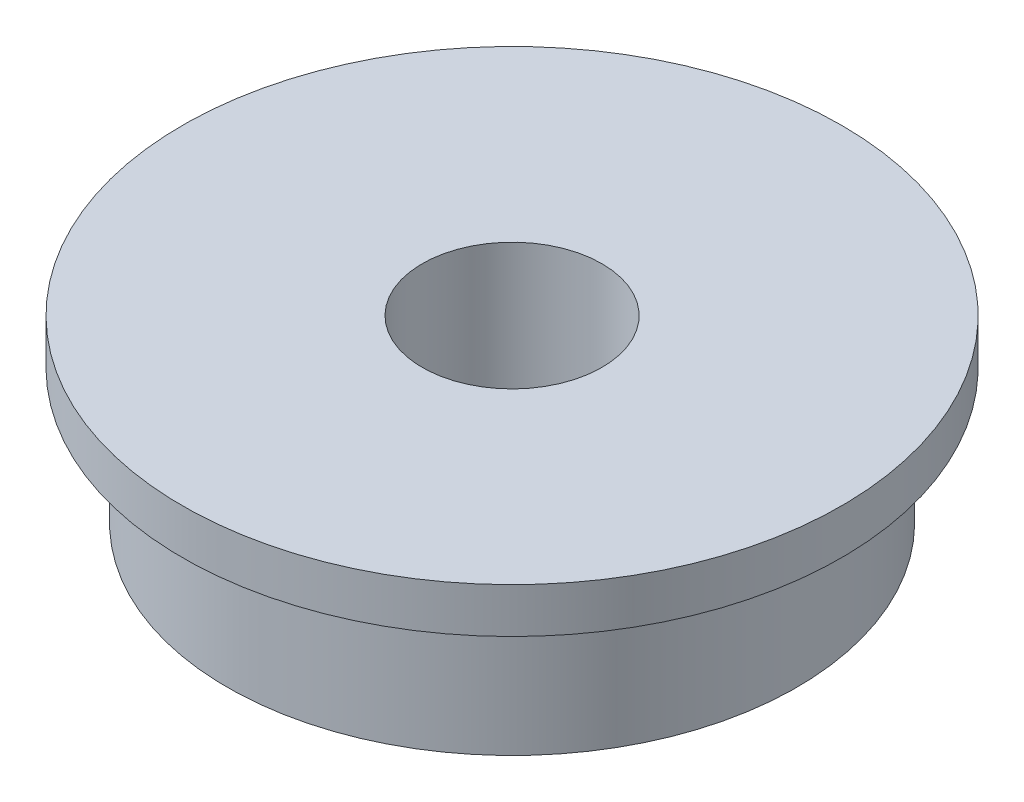
ISO-10303-21;
HEADER;
FILE_DESCRIPTION(('STEP AP214'),'2;1');
FILE_NAME('part.step','',(''),(''),'','','');
FILE_SCHEMA(('AUTOMOTIVE_DESIGN { 1 0 10303 214 1 1 1 1 }'));
ENDSEC;
DATA;
#1=APPLICATION_CONTEXT('core data for automotive mechanical design processes');
#2=APPLICATION_PROTOCOL_DEFINITION('international standard','automotive_design',2000,#1);
#3=PRODUCT_CONTEXT('',#1,'mechanical');
#4=PRODUCT('Part','Part','',(#3));
#5=PRODUCT_RELATED_PRODUCT_CATEGORY('part','',(#4));
#6=PRODUCT_DEFINITION_FORMATION('','',#4);
#7=PRODUCT_DEFINITION_CONTEXT('part definition',#1,'design');
#8=PRODUCT_DEFINITION('design','',#6,#7);
#9=PRODUCT_DEFINITION_SHAPE('','',#8);
#10=(LENGTH_UNIT() NAMED_UNIT(*) SI_UNIT(.MILLI.,.METRE.));
#11=(NAMED_UNIT(*) PLANE_ANGLE_UNIT() SI_UNIT($,.RADIAN.));
#12=(NAMED_UNIT(*) SI_UNIT($,.STERADIAN.) SOLID_ANGLE_UNIT());
#13=UNCERTAINTY_MEASURE_WITH_UNIT(LENGTH_MEASURE(1.E-05),#10,'distance_accuracy_value','');
#14=(GEOMETRIC_REPRESENTATION_CONTEXT(3) GLOBAL_UNCERTAINTY_ASSIGNED_CONTEXT((#13)) GLOBAL_UNIT_ASSIGNED_CONTEXT((#10,
#11,#12)) REPRESENTATION_CONTEXT('',''));
#15=CARTESIAN_POINT('',(0.,0.,0.));
#16=DIRECTION('',(0.,0.,1.));
#17=DIRECTION('',(1.,0.,0.));
#18=AXIS2_PLACEMENT_3D('',#15,#16,#17);
#19=CARTESIAN_POINT('',(0.,0.,0.));
#20=DIRECTION('',(0.,-1.,0.));
#21=DIRECTION('',(0.,0.,-1.));
#22=AXIS2_PLACEMENT_3D('',#19,#20,#21);
#23=CYLINDRICAL_SURFACE('',#22,9.5);
#24=CARTESIAN_POINT('',(0.,4.5,0.));
#25=DIRECTION('',(0.,-1.,0.));
#26=DIRECTION('',(0.,0.,-1.));
#27=AXIS2_PLACEMENT_3D('',#24,#25,#26);
#28=CIRCLE('',#27,9.5);
#29=CARTESIAN_POINT('',(0.,4.5,-9.5));
#30=VERTEX_POINT('',#29);
#31=EDGE_CURVE('E59',#30,#30,#28,.T.);
#32=ORIENTED_EDGE('',*,*,#31,.T.);
#33=EDGE_LOOP('',(#32));
#34=FACE_BOUND('',#33,.T.);
#35=CARTESIAN_POINT('',(0.,0.,0.));
#36=DIRECTION('',(0.,-1.,0.));
#37=DIRECTION('',(0.,0.,-1.));
#38=AXIS2_PLACEMENT_3D('',#35,#36,#37);
#39=CIRCLE('',#38,9.5);
#40=CARTESIAN_POINT('',(0.,0.,-9.5));
#41=VERTEX_POINT('',#40);
#42=EDGE_CURVE('E10',#41,#41,#39,.T.);
#43=ORIENTED_EDGE('',*,*,#42,.F.);
#44=EDGE_LOOP('',(#43));
#45=FACE_BOUND('',#44,.T.);
#46=ADVANCED_FACE('F37',(#34,#45),#23,.T.);
#47=CARTESIAN_POINT('',(9.5,0.,0.));
#48=DIRECTION('',(0.,-1.,0.));
#49=DIRECTION('',(0.,0.,-1.));
#50=AXIS2_PLACEMENT_3D('',#47,#48,#49);
#51=PLANE('',#50);
#52=ORIENTED_EDGE('',*,*,#42,.T.);
#53=EDGE_LOOP('',(#52));
#54=FACE_BOUND('',#53,.T.);
#55=CARTESIAN_POINT('',(0.,0.,0.));
#56=DIRECTION('',(0.,-1.,0.));
#57=DIRECTION('',(0.,0.,-1.));
#58=AXIS2_PLACEMENT_3D('',#55,#56,#57);
#59=CIRCLE('',#58,3.);
#60=CARTESIAN_POINT('',(0.,0.,-3.));
#61=VERTEX_POINT('',#60);
#62=EDGE_CURVE('E43',#61,#61,#59,.T.);
#63=ORIENTED_EDGE('',*,*,#62,.F.);
#64=EDGE_LOOP('',(#63));
#65=FACE_BOUND('',#64,.T.);
#66=ADVANCED_FACE('F77',(#54,#65),#51,.T.);
#67=CARTESIAN_POINT('',(0.,0.,0.));
#68=DIRECTION('',(0.,-1.,0.));
#69=DIRECTION('',(0.,0.,-1.));
#70=AXIS2_PLACEMENT_3D('',#67,#68,#69);
#71=CYLINDRICAL_SURFACE('',#70,3.);
#72=ORIENTED_EDGE('',*,*,#62,.T.);
#73=EDGE_LOOP('',(#72));
#74=FACE_BOUND('',#73,.T.);
#75=CARTESIAN_POINT('',(0.,6.,0.));
#76=DIRECTION('',(0.,-1.,0.));
#77=DIRECTION('',(0.,0.,-1.));
#78=AXIS2_PLACEMENT_3D('',#75,#76,#77);
#79=CIRCLE('',#78,3.);
#80=CARTESIAN_POINT('',(0.,6.,-3.));
#81=VERTEX_POINT('',#80);
#82=EDGE_CURVE('E47',#81,#81,#79,.T.);
#83=ORIENTED_EDGE('',*,*,#82,.F.);
#84=EDGE_LOOP('',(#83));
#85=FACE_BOUND('',#84,.T.);
#86=ADVANCED_FACE('F81',(#74,#85),#71,.F.);
#87=CARTESIAN_POINT('',(3.,6.,0.));
#88=DIRECTION('',(0.,1.,0.));
#89=DIRECTION('',(0.,0.,1.));
#90=AXIS2_PLACEMENT_3D('',#87,#88,#89);
#91=PLANE('',#90);
#92=ORIENTED_EDGE('',*,*,#82,.T.);
#93=EDGE_LOOP('',(#92));
#94=FACE_BOUND('',#93,.T.);
#95=CARTESIAN_POINT('',(0.,6.,0.));
#96=DIRECTION('',(0.,-1.,0.));
#97=DIRECTION('',(0.,0.,-1.));
#98=AXIS2_PLACEMENT_3D('',#95,#96,#97);
#99=CIRCLE('',#98,11.);
#100=CARTESIAN_POINT('',(0.,6.,-11.));
#101=VERTEX_POINT('',#100);
#102=EDGE_CURVE('E51',#101,#101,#99,.T.);
#103=ORIENTED_EDGE('',*,*,#102,.F.);
#104=EDGE_LOOP('',(#103));
#105=FACE_BOUND('',#104,.T.);
#106=ADVANCED_FACE('F73',(#94,#105),#91,.T.);
#107=CARTESIAN_POINT('',(0.,0.,0.));
#108=DIRECTION('',(0.,-1.,0.));
#109=DIRECTION('',(0.,0.,-1.));
#110=AXIS2_PLACEMENT_3D('',#107,#108,#109);
#111=CYLINDRICAL_SURFACE('',#110,11.);
#112=ORIENTED_EDGE('',*,*,#102,.T.);
#113=EDGE_LOOP('',(#112));
#114=FACE_BOUND('',#113,.T.);
#115=CARTESIAN_POINT('',(0.,4.5,0.));
#116=DIRECTION('',(0.,-1.,0.));
#117=DIRECTION('',(0.,0.,-1.));
#118=AXIS2_PLACEMENT_3D('',#115,#116,#117);
#119=CIRCLE('',#118,11.);
#120=CARTESIAN_POINT('',(0.,4.5,-11.));
#121=VERTEX_POINT('',#120);
#122=EDGE_CURVE('E56',#121,#121,#119,.T.);
#123=ORIENTED_EDGE('',*,*,#122,.F.);
#124=EDGE_LOOP('',(#123));
#125=FACE_BOUND('',#124,.T.);
#126=ADVANCED_FACE('F67',(#114,#125),#111,.T.);
#127=CARTESIAN_POINT('',(11.,4.5,0.));
#128=DIRECTION('',(0.,-1.,0.));
#129=DIRECTION('',(0.,0.,-1.));
#130=AXIS2_PLACEMENT_3D('',#127,#128,#129);
#131=PLANE('',#130);
#132=ORIENTED_EDGE('',*,*,#122,.T.);
#133=EDGE_LOOP('',(#132));
#134=FACE_BOUND('',#133,.T.);
#135=ORIENTED_EDGE('',*,*,#31,.F.);
#136=EDGE_LOOP('',(#135));
#137=FACE_BOUND('',#136,.T.);
#138=ADVANCED_FACE('F65',(#134,#137),#131,.T.);
#139=CLOSED_SHELL('',(#46,#66,#86,#106,#126,#138));
#140=MANIFOLD_SOLID_BREP('B2',#139);
#141=ADVANCED_BREP_SHAPE_REPRESENTATION('',(#18,#140),#14);
#142=SHAPE_DEFINITION_REPRESENTATION(#9,#141);
ENDSEC;
END-ISO-10303-21;
